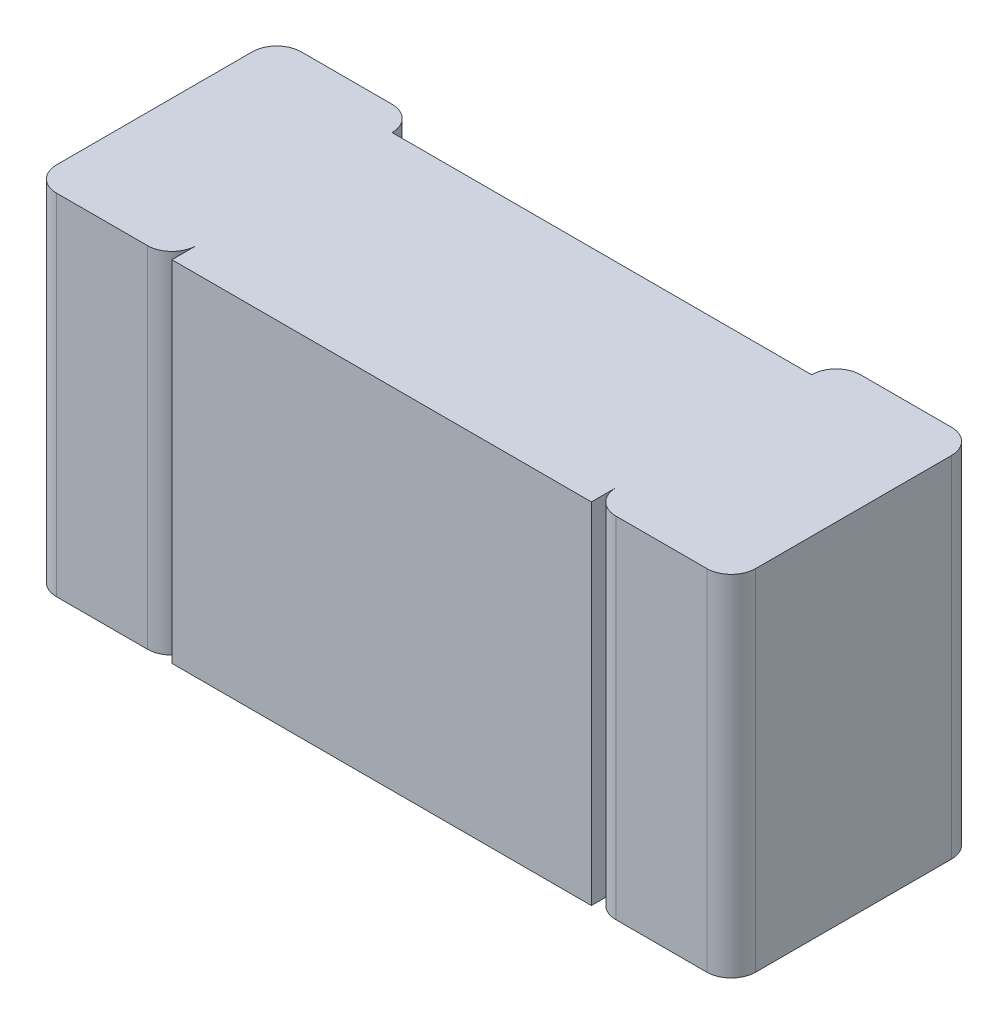
ISO-10303-21;
HEADER;
FILE_DESCRIPTION(('STEP AP214'),'2;1');
FILE_NAME('part.step','',(''),(''),'','','');
FILE_SCHEMA(('AUTOMOTIVE_DESIGN { 1 0 10303 214 1 1 1 1 }'));
ENDSEC;
DATA;
#1=APPLICATION_CONTEXT('core data for automotive mechanical design processes');
#2=APPLICATION_PROTOCOL_DEFINITION('international standard','automotive_design',2000,#1);
#3=PRODUCT_CONTEXT('',#1,'mechanical');
#4=PRODUCT('Part','Part','',(#3));
#5=PRODUCT_RELATED_PRODUCT_CATEGORY('part','',(#4));
#6=PRODUCT_DEFINITION_FORMATION('','',#4);
#7=PRODUCT_DEFINITION_CONTEXT('part definition',#1,'design');
#8=PRODUCT_DEFINITION('design','',#6,#7);
#9=PRODUCT_DEFINITION_SHAPE('','',#8);
#10=(LENGTH_UNIT() NAMED_UNIT(*) SI_UNIT(.MILLI.,.METRE.));
#11=(NAMED_UNIT(*) PLANE_ANGLE_UNIT() SI_UNIT($,.RADIAN.));
#12=(NAMED_UNIT(*) SI_UNIT($,.STERADIAN.) SOLID_ANGLE_UNIT());
#13=UNCERTAINTY_MEASURE_WITH_UNIT(LENGTH_MEASURE(1.E-05),#10,'distance_accuracy_value','');
#14=(GEOMETRIC_REPRESENTATION_CONTEXT(3) GLOBAL_UNCERTAINTY_ASSIGNED_CONTEXT((#13)) GLOBAL_UNIT_ASSIGNED_CONTEXT((#10,
#11,#12)) REPRESENTATION_CONTEXT('',''));
#15=CARTESIAN_POINT('',(0.,0.,0.));
#16=DIRECTION('',(0.,0.,1.));
#17=DIRECTION('',(1.,0.,0.));
#18=AXIS2_PLACEMENT_3D('',#15,#16,#17);
#19=CARTESIAN_POINT('',(-0.3,-0.25,0.35));
#20=DIRECTION('',(0.,0.,1.));
#21=DIRECTION('',(1.,0.,0.));
#22=AXIS2_PLACEMENT_3D('',#19,#20,#21);
#23=PLANE('',#22);
#24=DIRECTION('',(0.,1.,0.));
#25=VECTOR('',#24,1.);
#26=CARTESIAN_POINT('',(-0.3,-0.25,0.35));
#27=LINE('',#26,#25);
#28=CARTESIAN_POINT('',(-0.3,-0.25,0.35));
#29=VERTEX_POINT('',#28);
#30=CARTESIAN_POINT('',(-0.3,0.25,0.35));
#31=VERTEX_POINT('',#30);
#32=EDGE_CURVE('E384',#29,#31,#27,.T.);
#33=ORIENTED_EDGE('',*,*,#32,.F.);
#34=DIRECTION('',(1.,0.,0.));
#35=VECTOR('',#34,1.);
#36=CARTESIAN_POINT('',(-0.3,-0.25,0.35));
#37=LINE('',#36,#35);
#38=CARTESIAN_POINT('',(0.3,-0.25,0.35));
#39=VERTEX_POINT('',#38);
#40=EDGE_CURVE('E243',#29,#39,#37,.T.);
#41=ORIENTED_EDGE('',*,*,#40,.T.);
#42=DIRECTION('',(0.,1.,0.));
#43=VECTOR('',#42,1.);
#44=CARTESIAN_POINT('',(0.3,-0.25,0.35));
#45=LINE('',#44,#43);
#46=CARTESIAN_POINT('',(0.3,0.25,0.35));
#47=VERTEX_POINT('',#46);
#48=EDGE_CURVE('E11',#39,#47,#45,.T.);
#49=ORIENTED_EDGE('',*,*,#48,.T.);
#50=DIRECTION('',(1.,0.,0.));
#51=VECTOR('',#50,1.);
#52=CARTESIAN_POINT('',(-0.3,0.25,0.35));
#53=LINE('',#52,#51);
#54=EDGE_CURVE('E155',#31,#47,#53,.T.);
#55=ORIENTED_EDGE('',*,*,#54,.F.);
#56=EDGE_LOOP('',(#33,#41,#49,#55));
#57=FACE_BOUND('',#56,.T.);
#58=ADVANCED_FACE('F17',(#57),#23,.T.);
#59=CARTESIAN_POINT('',(0.3,-0.25,0.315));
#60=DIRECTION('',(1.,0.,0.));
#61=DIRECTION('',(0.,1.,0.));
#62=AXIS2_PLACEMENT_3D('',#59,#60,#61);
#63=PLANE('',#62);
#64=DIRECTION('',(0.,0.,1.));
#65=VECTOR('',#64,1.);
#66=CARTESIAN_POINT('',(0.3,-0.25,0.315));
#67=LINE('',#66,#65);
#68=CARTESIAN_POINT('',(0.3,-0.25,0.315));
#69=VERTEX_POINT('',#68);
#70=EDGE_CURVE('E239',#69,#39,#67,.T.);
#71=ORIENTED_EDGE('',*,*,#70,.F.);
#72=DIRECTION('',(0.,1.,0.));
#73=VECTOR('',#72,1.);
#74=CARTESIAN_POINT('',(0.3,-0.25,0.315));
#75=LINE('',#74,#73);
#76=CARTESIAN_POINT('',(0.3,0.25,0.315));
#77=VERTEX_POINT('',#76);
#78=EDGE_CURVE('E26',#69,#77,#75,.T.);
#79=ORIENTED_EDGE('',*,*,#78,.T.);
#80=DIRECTION('',(0.,0.,1.));
#81=VECTOR('',#80,1.);
#82=CARTESIAN_POINT('',(0.3,0.25,0.315));
#83=LINE('',#82,#81);
#84=EDGE_CURVE('E159',#77,#47,#83,.T.);
#85=ORIENTED_EDGE('',*,*,#84,.T.);
#86=ORIENTED_EDGE('',*,*,#48,.F.);
#87=EDGE_LOOP('',(#71,#79,#85,#86));
#88=FACE_BOUND('',#87,.T.);
#89=ADVANCED_FACE('F449',(#88),#63,.T.);
#90=CARTESIAN_POINT('',(0.335,-0.25,0.315));
#91=DIRECTION('',(0.,1.,0.));
#92=DIRECTION('',(-1.,0.,0.));
#93=AXIS2_PLACEMENT_3D('',#90,#91,#92);
#94=CYLINDRICAL_SURFACE('',#93,0.035);
#95=CARTESIAN_POINT('',(0.335,-0.25,0.315));
#96=DIRECTION('',(0.,1.,0.));
#97=DIRECTION('',(0.,0.,1.));
#98=AXIS2_PLACEMENT_3D('',#95,#96,#97);
#99=CIRCLE('',#98,0.035);
#100=CARTESIAN_POINT('',(0.335,-0.25,0.35));
#101=VERTEX_POINT('',#100);
#102=EDGE_CURVE('E183',#69,#101,#99,.T.);
#103=ORIENTED_EDGE('',*,*,#102,.T.);
#104=DIRECTION('',(0.,1.,0.));
#105=VECTOR('',#104,1.);
#106=CARTESIAN_POINT('',(0.335,-0.25,0.35));
#107=LINE('',#106,#105);
#108=CARTESIAN_POINT('',(0.335,0.25,0.35));
#109=VERTEX_POINT('',#108);
#110=EDGE_CURVE('E160',#101,#109,#107,.T.);
#111=ORIENTED_EDGE('',*,*,#110,.T.);
#112=CARTESIAN_POINT('',(0.335,0.25,0.315));
#113=DIRECTION('',(0.,1.,0.));
#114=DIRECTION('',(0.,0.,1.));
#115=AXIS2_PLACEMENT_3D('',#112,#113,#114);
#116=CIRCLE('',#115,0.035);
#117=EDGE_CURVE('E150',#77,#109,#116,.T.);
#118=ORIENTED_EDGE('',*,*,#117,.F.);
#119=ORIENTED_EDGE('',*,*,#78,.F.);
#120=EDGE_LOOP('',(#103,#111,#118,#119));
#121=FACE_BOUND('',#120,.T.);
#122=ADVANCED_FACE('F261',(#121),#94,.T.);
#123=CARTESIAN_POINT('',(0.3,-0.25,0.35));
#124=DIRECTION('',(0.,0.,1.));
#125=DIRECTION('',(1.,0.,0.));
#126=AXIS2_PLACEMENT_3D('',#123,#124,#125);
#127=PLANE('',#126);
#128=DIRECTION('',(1.,0.,0.));
#129=VECTOR('',#128,1.);
#130=CARTESIAN_POINT('',(0.3,0.25,0.35));
#131=LINE('',#130,#129);
#132=CARTESIAN_POINT('',(0.465,0.25,0.35));
#133=VERTEX_POINT('',#132);
#134=EDGE_CURVE('E144',#109,#133,#131,.T.);
#135=ORIENTED_EDGE('',*,*,#134,.F.);
#136=ORIENTED_EDGE('',*,*,#110,.F.);
#137=DIRECTION('',(1.,0.,0.));
#138=VECTOR('',#137,1.);
#139=CARTESIAN_POINT('',(0.3,-0.25,0.35));
#140=LINE('',#139,#138);
#141=CARTESIAN_POINT('',(0.465,-0.25,0.35));
#142=VERTEX_POINT('',#141);
#143=EDGE_CURVE('E178',#101,#142,#140,.T.);
#144=ORIENTED_EDGE('',*,*,#143,.T.);
#145=DIRECTION('',(0.,1.,0.));
#146=VECTOR('',#145,1.);
#147=CARTESIAN_POINT('',(0.465,-0.25,0.35));
#148=LINE('',#147,#146);
#149=EDGE_CURVE('E128',#142,#133,#148,.T.);
#150=ORIENTED_EDGE('',*,*,#149,.T.);
#151=EDGE_LOOP('',(#135,#136,#144,#150));
#152=FACE_BOUND('',#151,.T.);
#153=ADVANCED_FACE('F176',(#152),#127,.T.);
#154=CARTESIAN_POINT('',(0.465,-0.25,0.315));
#155=DIRECTION('',(0.,1.,0.));
#156=DIRECTION('',(1.,0.,0.));
#157=AXIS2_PLACEMENT_3D('',#154,#155,#156);
#158=CYLINDRICAL_SURFACE('',#157,0.035);
#159=DIRECTION('',(0.,1.,0.));
#160=VECTOR('',#159,1.);
#161=CARTESIAN_POINT('',(0.5,-0.25,0.315));
#162=LINE('',#161,#160);
#163=CARTESIAN_POINT('',(0.5,-0.25,0.315));
#164=VERTEX_POINT('',#163);
#165=CARTESIAN_POINT('',(0.5,0.25,0.315));
#166=VERTEX_POINT('',#165);
#167=EDGE_CURVE('E116',#164,#166,#162,.T.);
#168=ORIENTED_EDGE('',*,*,#167,.T.);
#169=CARTESIAN_POINT('',(0.465,0.25,0.315));
#170=DIRECTION('',(0.,-1.,0.));
#171=DIRECTION('',(0.,0.,1.));
#172=AXIS2_PLACEMENT_3D('',#169,#170,#171);
#173=CIRCLE('',#172,0.035);
#174=EDGE_CURVE('E120',#166,#133,#173,.T.);
#175=ORIENTED_EDGE('',*,*,#174,.T.);
#176=ORIENTED_EDGE('',*,*,#149,.F.);
#177=CARTESIAN_POINT('',(0.465,-0.25,0.315));
#178=DIRECTION('',(0.,-1.,0.));
#179=DIRECTION('',(0.,0.,1.));
#180=AXIS2_PLACEMENT_3D('',#177,#178,#179);
#181=CIRCLE('',#180,0.035);
#182=EDGE_CURVE('E123',#164,#142,#181,.T.);
#183=ORIENTED_EDGE('',*,*,#182,.F.);
#184=EDGE_LOOP('',(#168,#175,#176,#183));
#185=FACE_BOUND('',#184,.T.);
#186=ADVANCED_FACE('F118',(#185),#158,.T.);
#187=CARTESIAN_POINT('',(0.5,-0.25,0.));
#188=DIRECTION('',(1.,0.,0.));
#189=DIRECTION('',(0.,1.,0.));
#190=AXIS2_PLACEMENT_3D('',#187,#188,#189);
#191=PLANE('',#190);
#192=DIRECTION('',(0.,0.,1.));
#193=VECTOR('',#192,1.);
#194=CARTESIAN_POINT('',(0.5,-0.25,0.));
#195=LINE('',#194,#193);
#196=CARTESIAN_POINT('',(0.5,-0.25,0.035));
#197=VERTEX_POINT('',#196);
#198=EDGE_CURVE('E188',#197,#164,#195,.T.);
#199=ORIENTED_EDGE('',*,*,#198,.F.);
#200=DIRECTION('',(0.,1.,0.));
#201=VECTOR('',#200,1.);
#202=CARTESIAN_POINT('',(0.5,-0.25,0.035));
#203=LINE('',#202,#201);
#204=CARTESIAN_POINT('',(0.5,0.25,0.035));
#205=VERTEX_POINT('',#204);
#206=EDGE_CURVE('E129',#197,#205,#203,.T.);
#207=ORIENTED_EDGE('',*,*,#206,.T.);
#208=DIRECTION('',(0.,0.,1.));
#209=VECTOR('',#208,1.);
#210=CARTESIAN_POINT('',(0.5,0.25,0.));
#211=LINE('',#210,#209);
#212=EDGE_CURVE('E132',#205,#166,#211,.T.);
#213=ORIENTED_EDGE('',*,*,#212,.T.);
#214=ORIENTED_EDGE('',*,*,#167,.F.);
#215=EDGE_LOOP('',(#199,#207,#213,#214));
#216=FACE_BOUND('',#215,.T.);
#217=ADVANCED_FACE('F133',(#216),#191,.T.);
#218=CARTESIAN_POINT('',(0.465,-0.25,0.035));
#219=DIRECTION('',(0.,1.,0.));
#220=DIRECTION('',(1.,0.,0.));
#221=AXIS2_PLACEMENT_3D('',#218,#219,#220);
#222=CYLINDRICAL_SURFACE('',#221,0.035);
#223=CARTESIAN_POINT('',(0.465,-0.25,0.035));
#224=DIRECTION('',(0.,1.,0.));
#225=DIRECTION('',(0.,0.,1.));
#226=AXIS2_PLACEMENT_3D('',#223,#224,#225);
#227=CIRCLE('',#226,0.035);
#228=CARTESIAN_POINT('',(0.465,-0.25,0.));
#229=VERTEX_POINT('',#228);
#230=EDGE_CURVE('E195',#197,#229,#227,.T.);
#231=ORIENTED_EDGE('',*,*,#230,.T.);
#232=DIRECTION('',(0.,1.,0.));
#233=VECTOR('',#232,1.);
#234=CARTESIAN_POINT('',(0.465,-0.25,0.));
#235=LINE('',#234,#233);
#236=CARTESIAN_POINT('',(0.465,0.25,0.));
#237=VERTEX_POINT('',#236);
#238=EDGE_CURVE('E166',#229,#237,#235,.T.);
#239=ORIENTED_EDGE('',*,*,#238,.T.);
#240=CARTESIAN_POINT('',(0.465,0.25,0.035));
#241=DIRECTION('',(0.,1.,0.));
#242=DIRECTION('',(0.,0.,1.));
#243=AXIS2_PLACEMENT_3D('',#240,#241,#242);
#244=CIRCLE('',#243,0.035);
#245=EDGE_CURVE('E138',#205,#237,#244,.T.);
#246=ORIENTED_EDGE('',*,*,#245,.F.);
#247=ORIENTED_EDGE('',*,*,#206,.F.);
#248=EDGE_LOOP('',(#231,#239,#246,#247));
#249=FACE_BOUND('',#248,.T.);
#250=ADVANCED_FACE('F474',(#249),#222,.T.);
#251=CARTESIAN_POINT('',(0.3,-0.25,0.));
#252=DIRECTION('',(0.,0.,1.));
#253=DIRECTION('',(1.,0.,0.));
#254=AXIS2_PLACEMENT_3D('',#251,#252,#253);
#255=PLANE('',#254);
#256=ORIENTED_EDGE('',*,*,#238,.F.);
#257=DIRECTION('',(1.,0.,0.));
#258=VECTOR('',#257,1.);
#259=CARTESIAN_POINT('',(0.3,-0.25,0.));
#260=LINE('',#259,#258);
#261=CARTESIAN_POINT('',(0.335,-0.25,0.));
#262=VERTEX_POINT('',#261);
#263=EDGE_CURVE('E235',#262,#229,#260,.T.);
#264=ORIENTED_EDGE('',*,*,#263,.F.);
#265=DIRECTION('',(0.,1.,0.));
#266=VECTOR('',#265,1.);
#267=CARTESIAN_POINT('',(0.335,-0.25,0.));
#268=LINE('',#267,#266);
#269=CARTESIAN_POINT('',(0.335,0.25,0.));
#270=VERTEX_POINT('',#269);
#271=EDGE_CURVE('E163',#262,#270,#268,.T.);
#272=ORIENTED_EDGE('',*,*,#271,.T.);
#273=DIRECTION('',(1.,0.,0.));
#274=VECTOR('',#273,1.);
#275=CARTESIAN_POINT('',(0.3,0.25,0.));
#276=LINE('',#275,#274);
#277=EDGE_CURVE('E247',#270,#237,#276,.T.);
#278=ORIENTED_EDGE('',*,*,#277,.T.);
#279=EDGE_LOOP('',(#256,#264,#272,#278));
#280=FACE_BOUND('',#279,.T.);
#281=ADVANCED_FACE('F468',(#280),#255,.F.);
#282=CARTESIAN_POINT('',(0.335,-0.25,0.035));
#283=DIRECTION('',(0.,1.,0.));
#284=DIRECTION('',(-1.,0.,0.));
#285=AXIS2_PLACEMENT_3D('',#282,#283,#284);
#286=CYLINDRICAL_SURFACE('',#285,0.035);
#287=DIRECTION('',(0.,1.,0.));
#288=VECTOR('',#287,1.);
#289=CARTESIAN_POINT('',(0.3,-0.25,0.035));
#290=LINE('',#289,#288);
#291=CARTESIAN_POINT('',(0.3,-0.25,0.035));
#292=VERTEX_POINT('',#291);
#293=CARTESIAN_POINT('',(0.3,0.25,0.035));
#294=VERTEX_POINT('',#293);
#295=EDGE_CURVE('E220',#292,#294,#290,.T.);
#296=ORIENTED_EDGE('',*,*,#295,.T.);
#297=CARTESIAN_POINT('',(0.335,0.25,0.035));
#298=DIRECTION('',(0.,-1.,0.));
#299=DIRECTION('',(0.,0.,1.));
#300=AXIS2_PLACEMENT_3D('',#297,#298,#299);
#301=CIRCLE('',#300,0.035);
#302=EDGE_CURVE('E251',#294,#270,#301,.T.);
#303=ORIENTED_EDGE('',*,*,#302,.T.);
#304=ORIENTED_EDGE('',*,*,#271,.F.);
#305=CARTESIAN_POINT('',(0.335,-0.25,0.035));
#306=DIRECTION('',(0.,-1.,0.));
#307=DIRECTION('',(0.,0.,1.));
#308=AXIS2_PLACEMENT_3D('',#305,#306,#307);
#309=CIRCLE('',#308,0.035);
#310=EDGE_CURVE('E231',#292,#262,#309,.T.);
#311=ORIENTED_EDGE('',*,*,#310,.F.);
#312=EDGE_LOOP('',(#296,#303,#304,#311));
#313=FACE_BOUND('',#312,.T.);
#314=ADVANCED_FACE('F461',(#313),#286,.T.);
#315=CARTESIAN_POINT('',(-0.3,-0.25,0.315));
#316=DIRECTION('',(1.,0.,0.));
#317=DIRECTION('',(0.,1.,0.));
#318=AXIS2_PLACEMENT_3D('',#315,#316,#317);
#319=PLANE('',#318);
#320=ORIENTED_EDGE('',*,*,#32,.T.);
#321=DIRECTION('',(0.,0.,1.));
#322=VECTOR('',#321,1.);
#323=CARTESIAN_POINT('',(-0.3,0.25,0.315));
#324=LINE('',#323,#322);
#325=CARTESIAN_POINT('',(-0.3,0.25,0.315));
#326=VERTEX_POINT('',#325);
#327=EDGE_CURVE('E252',#326,#31,#324,.T.);
#328=ORIENTED_EDGE('',*,*,#327,.F.);
#329=DIRECTION('',(0.,1.,0.));
#330=VECTOR('',#329,1.);
#331=CARTESIAN_POINT('',(-0.3,-0.25,0.315));
#332=LINE('',#331,#330);
#333=CARTESIAN_POINT('',(-0.3,-0.25,0.315));
#334=VERTEX_POINT('',#333);
#335=EDGE_CURVE('E211',#334,#326,#332,.T.);
#336=ORIENTED_EDGE('',*,*,#335,.F.);
#337=DIRECTION('',(0.,0.,1.));
#338=VECTOR('',#337,1.);
#339=CARTESIAN_POINT('',(-0.3,-0.25,0.315));
#340=LINE('',#339,#338);
#341=EDGE_CURVE('E246',#334,#29,#340,.T.);
#342=ORIENTED_EDGE('',*,*,#341,.T.);
#343=EDGE_LOOP('',(#320,#328,#336,#342));
#344=FACE_BOUND('',#343,.T.);
#345=ADVANCED_FACE('F457',(#344),#319,.F.);
#346=CARTESIAN_POINT('',(-0.465,-0.25,0.035));
#347=DIRECTION('',(0.,0.,1.));
#348=DIRECTION('',(1.,0.,0.));
#349=AXIS2_PLACEMENT_3D('',#346,#347,#348);
#350=PLANE('',#349);
#351=DIRECTION('',(1.,0.,0.));
#352=VECTOR('',#351,1.);
#353=CARTESIAN_POINT('',(-0.465,0.25,0.035));
#354=LINE('',#353,#352);
#355=CARTESIAN_POINT('',(-0.3,0.25,0.035));
#356=VERTEX_POINT('',#355);
#357=EDGE_CURVE('E216',#356,#294,#354,.T.);
#358=ORIENTED_EDGE('',*,*,#357,.T.);
#359=ORIENTED_EDGE('',*,*,#295,.F.);
#360=DIRECTION('',(1.,0.,0.));
#361=VECTOR('',#360,1.);
#362=CARTESIAN_POINT('',(-0.465,-0.25,0.035));
#363=LINE('',#362,#361);
#364=CARTESIAN_POINT('',(-0.3,-0.25,0.035));
#365=VERTEX_POINT('',#364);
#366=EDGE_CURVE('E204',#365,#292,#363,.T.);
#367=ORIENTED_EDGE('',*,*,#366,.F.);
#368=DIRECTION('',(0.,1.,0.));
#369=VECTOR('',#368,1.);
#370=CARTESIAN_POINT('',(-0.3,-0.25,0.035));
#371=LINE('',#370,#369);
#372=EDGE_CURVE('E201',#365,#356,#371,.T.);
#373=ORIENTED_EDGE('',*,*,#372,.T.);
#374=EDGE_LOOP('',(#358,#359,#367,#373));
#375=FACE_BOUND('',#374,.T.);
#376=ADVANCED_FACE('F444',(#375),#350,.F.);
#377=CARTESIAN_POINT('',(-0.335,-0.25,0.315));
#378=DIRECTION('',(0.,1.,0.));
#379=DIRECTION('',(1.,0.,0.));
#380=AXIS2_PLACEMENT_3D('',#377,#378,#379);
#381=CYLINDRICAL_SURFACE('',#380,0.035);
#382=ORIENTED_EDGE('',*,*,#335,.T.);
#383=CARTESIAN_POINT('',(-0.335,0.25,0.315));
#384=DIRECTION('',(0.,-1.,0.));
#385=DIRECTION('',(0.,0.,1.));
#386=AXIS2_PLACEMENT_3D('',#383,#384,#385);
#387=CIRCLE('',#386,0.035);
#388=CARTESIAN_POINT('',(-0.335,0.25,0.35));
#389=VERTEX_POINT('',#388);
#390=EDGE_CURVE('E421',#326,#389,#387,.T.);
#391=ORIENTED_EDGE('',*,*,#390,.T.);
#392=DIRECTION('',(0.,1.,0.));
#393=VECTOR('',#392,1.);
#394=CARTESIAN_POINT('',(-0.335,-0.25,0.35));
#395=LINE('',#394,#393);
#396=CARTESIAN_POINT('',(-0.335,-0.25,0.35));
#397=VERTEX_POINT('',#396);
#398=EDGE_CURVE('E208',#397,#389,#395,.T.);
#399=ORIENTED_EDGE('',*,*,#398,.F.);
#400=CARTESIAN_POINT('',(-0.335,-0.25,0.315));
#401=DIRECTION('',(0.,-1.,0.));
#402=DIRECTION('',(0.,0.,1.));
#403=AXIS2_PLACEMENT_3D('',#400,#401,#402);
#404=CIRCLE('',#403,0.035);
#405=EDGE_CURVE('E391',#334,#397,#404,.T.);
#406=ORIENTED_EDGE('',*,*,#405,.F.);
#407=EDGE_LOOP('',(#382,#391,#399,#406));
#408=FACE_BOUND('',#407,.T.);
#409=ADVANCED_FACE('F436',(#408),#381,.T.);
#410=CARTESIAN_POINT('',(-0.5,-0.25,0.35));
#411=DIRECTION('',(0.,0.,1.));
#412=DIRECTION('',(1.,0.,0.));
#413=AXIS2_PLACEMENT_3D('',#410,#411,#412);
#414=PLANE('',#413);
#415=DIRECTION('',(1.,0.,0.));
#416=VECTOR('',#415,1.);
#417=CARTESIAN_POINT('',(-0.5,0.25,0.35));
#418=LINE('',#417,#416);
#419=CARTESIAN_POINT('',(-0.465,0.25,0.35));
#420=VERTEX_POINT('',#419);
#421=EDGE_CURVE('E414',#420,#389,#418,.T.);
#422=ORIENTED_EDGE('',*,*,#421,.F.);
#423=DIRECTION('',(0.,1.,0.));
#424=VECTOR('',#423,1.);
#425=CARTESIAN_POINT('',(-0.465,-0.25,0.35));
#426=LINE('',#425,#424);
#427=CARTESIAN_POINT('',(-0.465,-0.25,0.35));
#428=VERTEX_POINT('',#427);
#429=EDGE_CURVE('E317',#428,#420,#426,.T.);
#430=ORIENTED_EDGE('',*,*,#429,.F.);
#431=DIRECTION('',(1.,0.,0.));
#432=VECTOR('',#431,1.);
#433=CARTESIAN_POINT('',(-0.5,-0.25,0.35));
#434=LINE('',#433,#432);
#435=EDGE_CURVE('E359',#428,#397,#434,.T.);
#436=ORIENTED_EDGE('',*,*,#435,.T.);
#437=ORIENTED_EDGE('',*,*,#398,.T.);
#438=EDGE_LOOP('',(#422,#430,#436,#437));
#439=FACE_BOUND('',#438,.T.);
#440=ADVANCED_FACE('F433',(#439),#414,.T.);
#441=CARTESIAN_POINT('',(-0.335,-0.25,0.035));
#442=DIRECTION('',(0.,1.,0.));
#443=DIRECTION('',(1.,0.,0.));
#444=AXIS2_PLACEMENT_3D('',#441,#442,#443);
#445=CYLINDRICAL_SURFACE('',#444,0.035);
#446=CARTESIAN_POINT('',(-0.335,-0.25,0.035));
#447=DIRECTION('',(0.,1.,0.));
#448=DIRECTION('',(0.,0.,1.));
#449=AXIS2_PLACEMENT_3D('',#446,#447,#448);
#450=CIRCLE('',#449,0.035);
#451=CARTESIAN_POINT('',(-0.335,-0.25,0.));
#452=VERTEX_POINT('',#451);
#453=EDGE_CURVE('E370',#365,#452,#450,.T.);
#454=ORIENTED_EDGE('',*,*,#453,.T.);
#455=DIRECTION('',(0.,1.,0.));
#456=VECTOR('',#455,1.);
#457=CARTESIAN_POINT('',(-0.335,-0.25,0.));
#458=LINE('',#457,#456);
#459=CARTESIAN_POINT('',(-0.335,0.25,0.));
#460=VERTEX_POINT('',#459);
#461=EDGE_CURVE('E199',#452,#460,#458,.T.);
#462=ORIENTED_EDGE('',*,*,#461,.T.);
#463=CARTESIAN_POINT('',(-0.335,0.25,0.035));
#464=DIRECTION('',(0.,1.,0.));
#465=DIRECTION('',(0.,0.,1.));
#466=AXIS2_PLACEMENT_3D('',#463,#464,#465);
#467=CIRCLE('',#466,0.035);
#468=EDGE_CURVE('E423',#356,#460,#467,.T.);
#469=ORIENTED_EDGE('',*,*,#468,.F.);
#470=ORIENTED_EDGE('',*,*,#372,.F.);
#471=EDGE_LOOP('',(#454,#462,#469,#470));
#472=FACE_BOUND('',#471,.T.);
#473=ADVANCED_FACE('F435',(#472),#445,.T.);
#474=CARTESIAN_POINT('',(-0.5,-0.25,0.));
#475=DIRECTION('',(0.,0.,1.));
#476=DIRECTION('',(1.,0.,0.));
#477=AXIS2_PLACEMENT_3D('',#474,#475,#476);
#478=PLANE('',#477);
#479=ORIENTED_EDGE('',*,*,#461,.F.);
#480=DIRECTION('',(1.,0.,0.));
#481=VECTOR('',#480,1.);
#482=CARTESIAN_POINT('',(-0.5,-0.25,0.));
#483=LINE('',#482,#481);
#484=CARTESIAN_POINT('',(-0.465,-0.25,0.));
#485=VERTEX_POINT('',#484);
#486=EDGE_CURVE('E388',#485,#452,#483,.T.);
#487=ORIENTED_EDGE('',*,*,#486,.F.);
#488=DIRECTION('',(0.,1.,0.));
#489=VECTOR('',#488,1.);
#490=CARTESIAN_POINT('',(-0.465,-0.25,0.));
#491=LINE('',#490,#489);
#492=CARTESIAN_POINT('',(-0.465,0.25,0.));
#493=VERTEX_POINT('',#492);
#494=EDGE_CURVE('E329',#485,#493,#491,.T.);
#495=ORIENTED_EDGE('',*,*,#494,.T.);
#496=DIRECTION('',(1.,0.,0.));
#497=VECTOR('',#496,1.);
#498=CARTESIAN_POINT('',(-0.5,0.25,0.));
#499=LINE('',#498,#497);
#500=EDGE_CURVE('E410',#493,#460,#499,.T.);
#501=ORIENTED_EDGE('',*,*,#500,.T.);
#502=EDGE_LOOP('',(#479,#487,#495,#501));
#503=FACE_BOUND('',#502,.T.);
#504=ADVANCED_FACE('F431',(#503),#478,.F.);
#505=CARTESIAN_POINT('',(-0.5,0.25,0.));
#506=DIRECTION('',(0.,1.,0.));
#507=DIRECTION('',(1.,0.,0.));
#508=AXIS2_PLACEMENT_3D('',#505,#506,#507);
#509=PLANE('',#508);
#510=ORIENTED_EDGE('',*,*,#390,.F.);
#511=ORIENTED_EDGE('',*,*,#327,.T.);
#512=ORIENTED_EDGE('',*,*,#54,.T.);
#513=ORIENTED_EDGE('',*,*,#84,.F.);
#514=ORIENTED_EDGE('',*,*,#117,.T.);
#515=ORIENTED_EDGE('',*,*,#134,.T.);
#516=ORIENTED_EDGE('',*,*,#174,.F.);
#517=ORIENTED_EDGE('',*,*,#212,.F.);
#518=ORIENTED_EDGE('',*,*,#245,.T.);
#519=ORIENTED_EDGE('',*,*,#277,.F.);
#520=ORIENTED_EDGE('',*,*,#302,.F.);
#521=ORIENTED_EDGE('',*,*,#357,.F.);
#522=ORIENTED_EDGE('',*,*,#468,.T.);
#523=ORIENTED_EDGE('',*,*,#500,.F.);
#524=CARTESIAN_POINT('',(-0.465,0.25,0.035));
#525=DIRECTION('',(0.,-1.,0.));
#526=DIRECTION('',(0.,0.,1.));
#527=AXIS2_PLACEMENT_3D('',#524,#525,#526);
#528=CIRCLE('',#527,0.035);
#529=CARTESIAN_POINT('',(-0.5,0.25,0.035));
#530=VERTEX_POINT('',#529);
#531=EDGE_CURVE('E338',#530,#493,#528,.T.);
#532=ORIENTED_EDGE('',*,*,#531,.F.);
#533=DIRECTION('',(0.,0.,1.));
#534=VECTOR('',#533,1.);
#535=CARTESIAN_POINT('',(-0.5,0.25,0.));
#536=LINE('',#535,#534);
#537=CARTESIAN_POINT('',(-0.5,0.25,0.315));
#538=VERTEX_POINT('',#537);
#539=EDGE_CURVE('E374',#530,#538,#536,.T.);
#540=ORIENTED_EDGE('',*,*,#539,.T.);
#541=CARTESIAN_POINT('',(-0.465,0.25,0.315));
#542=DIRECTION('',(0.,1.,0.));
#543=DIRECTION('',(0.,0.,1.));
#544=AXIS2_PLACEMENT_3D('',#541,#542,#543);
#545=CIRCLE('',#544,0.035);
#546=EDGE_CURVE('E347',#538,#420,#545,.T.);
#547=ORIENTED_EDGE('',*,*,#546,.T.);
#548=ORIENTED_EDGE('',*,*,#421,.T.);
#549=EDGE_LOOP('',(#510,#511,#512,#513,#514,#515,#516,#517,#518,#519,#520,#521,#522,#523,#532,
#540,#547,#548));
#550=FACE_BOUND('',#549,.T.);
#551=ADVANCED_FACE('F141',(#550),#509,.T.);
#552=CARTESIAN_POINT('',(-0.465,-0.25,0.315));
#553=DIRECTION('',(0.,1.,0.));
#554=DIRECTION('',(-1.,0.,0.));
#555=AXIS2_PLACEMENT_3D('',#552,#553,#554);
#556=CYLINDRICAL_SURFACE('',#555,0.035);
#557=CARTESIAN_POINT('',(-0.465,-0.25,0.315));
#558=DIRECTION('',(0.,1.,0.));
#559=DIRECTION('',(0.,0.,1.));
#560=AXIS2_PLACEMENT_3D('',#557,#558,#559);
#561=CIRCLE('',#560,0.035);
#562=CARTESIAN_POINT('',(-0.5,-0.25,0.315));
#563=VERTEX_POINT('',#562);
#564=EDGE_CURVE('E353',#563,#428,#561,.T.);
#565=ORIENTED_EDGE('',*,*,#564,.T.);
#566=ORIENTED_EDGE('',*,*,#429,.T.);
#567=ORIENTED_EDGE('',*,*,#546,.F.);
#568=DIRECTION('',(0.,1.,0.));
#569=VECTOR('',#568,1.);
#570=CARTESIAN_POINT('',(-0.5,-0.25,0.315));
#571=LINE('',#570,#569);
#572=EDGE_CURVE('E367',#563,#538,#571,.T.);
#573=ORIENTED_EDGE('',*,*,#572,.F.);
#574=EDGE_LOOP('',(#565,#566,#567,#573));
#575=FACE_BOUND('',#574,.T.);
#576=ADVANCED_FACE('F372',(#575),#556,.T.);
#577=CARTESIAN_POINT('',(-0.465,-0.25,0.035));
#578=DIRECTION('',(0.,1.,0.));
#579=DIRECTION('',(-1.,0.,0.));
#580=AXIS2_PLACEMENT_3D('',#577,#578,#579);
#581=CYLINDRICAL_SURFACE('',#580,0.035);
#582=DIRECTION('',(0.,1.,0.));
#583=VECTOR('',#582,1.);
#584=CARTESIAN_POINT('',(-0.5,-0.25,0.035));
#585=LINE('',#584,#583);
#586=CARTESIAN_POINT('',(-0.5,-0.25,0.035));
#587=VERTEX_POINT('',#586);
#588=EDGE_CURVE('E368',#587,#530,#585,.T.);
#589=ORIENTED_EDGE('',*,*,#588,.T.);
#590=ORIENTED_EDGE('',*,*,#531,.T.);
#591=ORIENTED_EDGE('',*,*,#494,.F.);
#592=CARTESIAN_POINT('',(-0.465,-0.25,0.035));
#593=DIRECTION('',(0.,-1.,0.));
#594=DIRECTION('',(0.,0.,1.));
#595=AXIS2_PLACEMENT_3D('',#592,#593,#594);
#596=CIRCLE('',#595,0.035);
#597=EDGE_CURVE('E361',#587,#485,#596,.T.);
#598=ORIENTED_EDGE('',*,*,#597,.F.);
#599=EDGE_LOOP('',(#589,#590,#591,#598));
#600=FACE_BOUND('',#599,.T.);
#601=ADVANCED_FACE('F432',(#600),#581,.T.);
#602=CARTESIAN_POINT('',(-0.5,-0.25,0.));
#603=DIRECTION('',(0.,1.,0.));
#604=DIRECTION('',(1.,0.,0.));
#605=AXIS2_PLACEMENT_3D('',#602,#603,#604);
#606=PLANE('',#605);
#607=ORIENTED_EDGE('',*,*,#453,.F.);
#608=ORIENTED_EDGE('',*,*,#366,.T.);
#609=ORIENTED_EDGE('',*,*,#310,.T.);
#610=ORIENTED_EDGE('',*,*,#263,.T.);
#611=ORIENTED_EDGE('',*,*,#230,.F.);
#612=ORIENTED_EDGE('',*,*,#198,.T.);
#613=ORIENTED_EDGE('',*,*,#182,.T.);
#614=ORIENTED_EDGE('',*,*,#143,.F.);
#615=ORIENTED_EDGE('',*,*,#102,.F.);
#616=ORIENTED_EDGE('',*,*,#70,.T.);
#617=ORIENTED_EDGE('',*,*,#40,.F.);
#618=ORIENTED_EDGE('',*,*,#341,.F.);
#619=ORIENTED_EDGE('',*,*,#405,.T.);
#620=ORIENTED_EDGE('',*,*,#435,.F.);
#621=ORIENTED_EDGE('',*,*,#564,.F.);
#622=DIRECTION('',(0.,0.,1.));
#623=VECTOR('',#622,1.);
#624=CARTESIAN_POINT('',(-0.5,-0.25,0.));
#625=LINE('',#624,#623);
#626=EDGE_CURVE('E356',#587,#563,#625,.T.);
#627=ORIENTED_EDGE('',*,*,#626,.F.);
#628=ORIENTED_EDGE('',*,*,#597,.T.);
#629=ORIENTED_EDGE('',*,*,#486,.T.);
#630=EDGE_LOOP('',(#607,#608,#609,#610,#611,#612,#613,#614,#615,#616,#617,#618,#619,#620,#621,
#627,#628,#629));
#631=FACE_BOUND('',#630,.T.);
#632=ADVANCED_FACE('F186',(#631),#606,.F.);
#633=CARTESIAN_POINT('',(-0.5,-0.25,0.));
#634=DIRECTION('',(1.,0.,0.));
#635=DIRECTION('',(0.,1.,0.));
#636=AXIS2_PLACEMENT_3D('',#633,#634,#635);
#637=PLANE('',#636);
#638=ORIENTED_EDGE('',*,*,#572,.T.);
#639=ORIENTED_EDGE('',*,*,#539,.F.);
#640=ORIENTED_EDGE('',*,*,#588,.F.);
#641=ORIENTED_EDGE('',*,*,#626,.T.);
#642=EDGE_LOOP('',(#638,#639,#640,#641));
#643=FACE_BOUND('',#642,.T.);
#644=ADVANCED_FACE('F365',(#643),#637,.F.);
#645=CLOSED_SHELL('',(#58,#89,#122,#153,#186,#217,#250,#281,#314,#345,#376,#409,#440,#473,#504,
#551,#576,#601,#632,#644));
#646=MANIFOLD_SOLID_BREP('B1',#645);
#647=ADVANCED_BREP_SHAPE_REPRESENTATION('',(#18,#646),#14);
#648=SHAPE_DEFINITION_REPRESENTATION(#9,#647);
ENDSEC;
END-ISO-10303-21;
